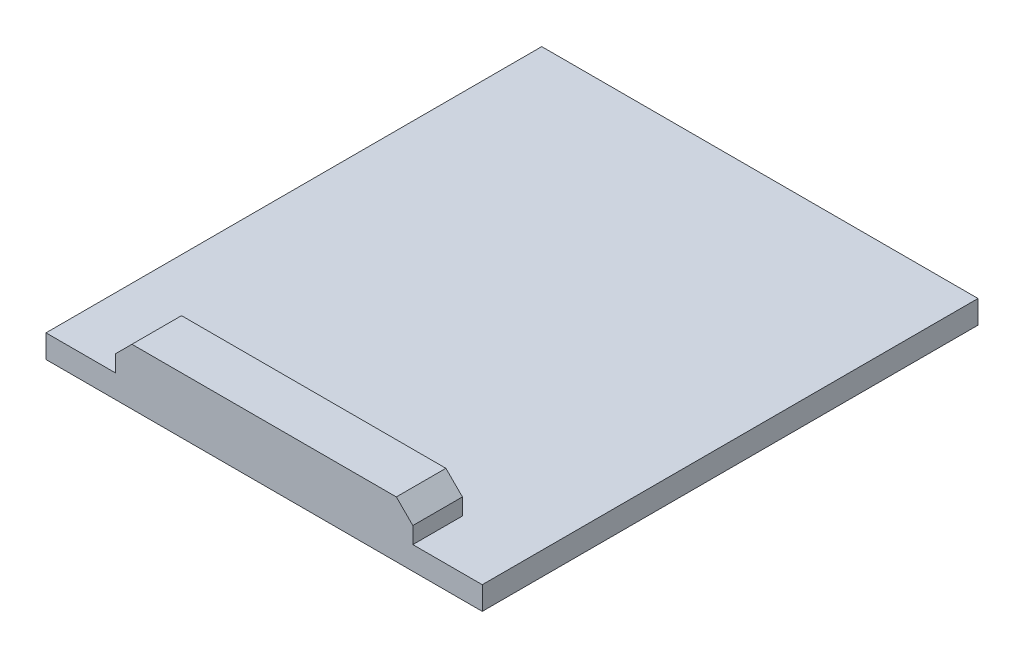
ISO-10303-21;
HEADER;
FILE_DESCRIPTION(('STEP AP214'),'2;1');
FILE_NAME('part.step','',(''),(''),'','','');
FILE_SCHEMA(('AUTOMOTIVE_DESIGN { 1 0 10303 214 1 1 1 1 }'));
ENDSEC;
DATA;
#1=APPLICATION_CONTEXT('core data for automotive mechanical design processes');
#2=APPLICATION_PROTOCOL_DEFINITION('international standard','automotive_design',2000,#1);
#3=PRODUCT_CONTEXT('',#1,'mechanical');
#4=PRODUCT('Part','Part','',(#3));
#5=PRODUCT_RELATED_PRODUCT_CATEGORY('part','',(#4));
#6=PRODUCT_DEFINITION_FORMATION('','',#4);
#7=PRODUCT_DEFINITION_CONTEXT('part definition',#1,'design');
#8=PRODUCT_DEFINITION('design','',#6,#7);
#9=PRODUCT_DEFINITION_SHAPE('','',#8);
#10=(LENGTH_UNIT() NAMED_UNIT(*) SI_UNIT(.MILLI.,.METRE.));
#11=(NAMED_UNIT(*) PLANE_ANGLE_UNIT() SI_UNIT($,.RADIAN.));
#12=(NAMED_UNIT(*) SI_UNIT($,.STERADIAN.) SOLID_ANGLE_UNIT());
#13=UNCERTAINTY_MEASURE_WITH_UNIT(LENGTH_MEASURE(1.E-05),#10,'distance_accuracy_value','');
#14=(GEOMETRIC_REPRESENTATION_CONTEXT(3) GLOBAL_UNCERTAINTY_ASSIGNED_CONTEXT((#13)) GLOBAL_UNIT_ASSIGNED_CONTEXT((#10,
#11,#12)) REPRESENTATION_CONTEXT('',''));
#15=CARTESIAN_POINT('',(0.,0.,0.));
#16=DIRECTION('',(0.,0.,1.));
#17=DIRECTION('',(1.,0.,0.));
#18=AXIS2_PLACEMENT_3D('',#15,#16,#17);
#19=CARTESIAN_POINT('',(26.4,1.4,30.));
#20=DIRECTION('',(0.,-1.,0.));
#21=DIRECTION('',(1.,0.,0.));
#22=AXIS2_PLACEMENT_3D('',#19,#20,#21);
#23=PLANE('',#22);
#24=DIRECTION('',(0.,0.,1.));
#25=VECTOR('',#24,1.);
#26=CARTESIAN_POINT('',(4.2,1.4,27.));
#27=LINE('',#26,#25);
#28=CARTESIAN_POINT('',(4.2,1.4,27.));
#29=VERTEX_POINT('',#28);
#30=CARTESIAN_POINT('',(4.2,1.4,30.));
#31=VERTEX_POINT('',#30);
#32=EDGE_CURVE('E139',#29,#31,#27,.T.);
#33=ORIENTED_EDGE('',*,*,#32,.F.);
#34=DIRECTION('',(1.,0.,0.));
#35=VECTOR('',#34,1.);
#36=CARTESIAN_POINT('',(22.2,1.4,27.));
#37=LINE('',#36,#35);
#38=CARTESIAN_POINT('',(22.2,1.4,27.));
#39=VERTEX_POINT('',#38);
#40=EDGE_CURVE('E132',#29,#39,#37,.T.);
#41=ORIENTED_EDGE('',*,*,#40,.T.);
#42=DIRECTION('',(0.,0.,1.));
#43=VECTOR('',#42,1.);
#44=CARTESIAN_POINT('',(22.2,1.4,27.));
#45=LINE('',#44,#43);
#46=CARTESIAN_POINT('',(22.2,1.4,30.));
#47=VERTEX_POINT('',#46);
#48=EDGE_CURVE('E118',#39,#47,#45,.T.);
#49=ORIENTED_EDGE('',*,*,#48,.T.);
#50=DIRECTION('',(-1.,0.,0.));
#51=VECTOR('',#50,1.);
#52=CARTESIAN_POINT('',(26.4,1.4,30.));
#53=LINE('',#52,#51);
#54=CARTESIAN_POINT('',(26.4,1.4,30.));
#55=VERTEX_POINT('',#54);
#56=EDGE_CURVE('E176',#55,#47,#53,.T.);
#57=ORIENTED_EDGE('',*,*,#56,.F.);
#58=DIRECTION('',(0.,0.,-1.));
#59=VECTOR('',#58,1.);
#60=CARTESIAN_POINT('',(26.4,1.4,30.));
#61=LINE('',#60,#59);
#62=CARTESIAN_POINT('',(26.4,1.4,0.));
#63=VERTEX_POINT('',#62);
#64=EDGE_CURVE('E187',#55,#63,#61,.T.);
#65=ORIENTED_EDGE('',*,*,#64,.T.);
#66=DIRECTION('',(-1.,0.,0.));
#67=VECTOR('',#66,1.);
#68=CARTESIAN_POINT('',(26.4,1.4,0.));
#69=LINE('',#68,#67);
#70=CARTESIAN_POINT('',(0.,1.4,0.));
#71=VERTEX_POINT('',#70);
#72=EDGE_CURVE('E79',#63,#71,#69,.T.);
#73=ORIENTED_EDGE('',*,*,#72,.T.);
#74=DIRECTION('',(0.,0.,-1.));
#75=VECTOR('',#74,1.);
#76=CARTESIAN_POINT('',(0.,1.4,30.));
#77=LINE('',#76,#75);
#78=CARTESIAN_POINT('',(0.,1.4,30.));
#79=VERTEX_POINT('',#78);
#80=EDGE_CURVE('E178',#79,#71,#77,.T.);
#81=ORIENTED_EDGE('',*,*,#80,.F.);
#82=EDGE_CURVE('E57',#31,#79,#53,.T.);
#83=ORIENTED_EDGE('',*,*,#82,.F.);
#84=EDGE_LOOP('',(#33,#41,#49,#57,#65,#73,#81,#83));
#85=FACE_BOUND('',#84,.T.);
#86=ADVANCED_FACE('F33',(#85),#23,.F.);
#87=CARTESIAN_POINT('',(0.,1.4,30.));
#88=DIRECTION('',(1.,0.,0.));
#89=DIRECTION('',(0.,1.,0.));
#90=AXIS2_PLACEMENT_3D('',#87,#88,#89);
#91=PLANE('',#90);
#92=DIRECTION('',(0.,-1.,0.));
#93=VECTOR('',#92,1.);
#94=CARTESIAN_POINT('',(0.,1.4,0.));
#95=LINE('',#94,#93);
#96=CARTESIAN_POINT('',(0.,0.,0.));
#97=VERTEX_POINT('',#96);
#98=EDGE_CURVE('E163',#71,#97,#95,.T.);
#99=ORIENTED_EDGE('',*,*,#98,.T.);
#100=DIRECTION('',(0.,0.,-1.));
#101=VECTOR('',#100,1.);
#102=CARTESIAN_POINT('',(0.,0.,30.));
#103=LINE('',#102,#101);
#104=CARTESIAN_POINT('',(0.,0.,30.));
#105=VERTEX_POINT('',#104);
#106=EDGE_CURVE('E11',#105,#97,#103,.T.);
#107=ORIENTED_EDGE('',*,*,#106,.F.);
#108=DIRECTION('',(0.,-1.,0.));
#109=VECTOR('',#108,1.);
#110=CARTESIAN_POINT('',(0.,1.4,30.));
#111=LINE('',#110,#109);
#112=EDGE_CURVE('E171',#79,#105,#111,.T.);
#113=ORIENTED_EDGE('',*,*,#112,.F.);
#114=ORIENTED_EDGE('',*,*,#80,.T.);
#115=EDGE_LOOP('',(#99,#107,#113,#114));
#116=FACE_BOUND('',#115,.T.);
#117=ADVANCED_FACE('F35',(#116),#91,.F.);
#118=CARTESIAN_POINT('',(0.,0.,30.));
#119=DIRECTION('',(0.,1.,0.));
#120=DIRECTION('',(0.,0.,1.));
#121=AXIS2_PLACEMENT_3D('',#118,#119,#120);
#122=PLANE('',#121);
#123=DIRECTION('',(1.,0.,0.));
#124=VECTOR('',#123,1.);
#125=CARTESIAN_POINT('',(0.,0.,0.));
#126=LINE('',#125,#124);
#127=CARTESIAN_POINT('',(26.4,0.,0.));
#128=VERTEX_POINT('',#127);
#129=EDGE_CURVE('E181',#97,#128,#126,.T.);
#130=ORIENTED_EDGE('',*,*,#129,.T.);
#131=DIRECTION('',(0.,0.,-1.));
#132=VECTOR('',#131,1.);
#133=CARTESIAN_POINT('',(26.4,0.,30.));
#134=LINE('',#133,#132);
#135=CARTESIAN_POINT('',(26.4,0.,30.));
#136=VERTEX_POINT('',#135);
#137=EDGE_CURVE('E41',#136,#128,#134,.T.);
#138=ORIENTED_EDGE('',*,*,#137,.F.);
#139=DIRECTION('',(1.,0.,0.));
#140=VECTOR('',#139,1.);
#141=CARTESIAN_POINT('',(0.,0.,30.));
#142=LINE('',#141,#140);
#143=EDGE_CURVE('E86',#105,#136,#142,.T.);
#144=ORIENTED_EDGE('',*,*,#143,.F.);
#145=ORIENTED_EDGE('',*,*,#106,.T.);
#146=EDGE_LOOP('',(#130,#138,#144,#145));
#147=FACE_BOUND('',#146,.T.);
#148=ADVANCED_FACE('F228',(#147),#122,.F.);
#149=CARTESIAN_POINT('',(26.4,0.,30.));
#150=DIRECTION('',(-1.,0.,0.));
#151=DIRECTION('',(0.,0.,1.));
#152=AXIS2_PLACEMENT_3D('',#149,#150,#151);
#153=PLANE('',#152);
#154=DIRECTION('',(0.,1.,0.));
#155=VECTOR('',#154,1.);
#156=CARTESIAN_POINT('',(26.4,0.,0.));
#157=LINE('',#156,#155);
#158=EDGE_CURVE('E183',#128,#63,#157,.T.);
#159=ORIENTED_EDGE('',*,*,#158,.T.);
#160=ORIENTED_EDGE('',*,*,#64,.F.);
#161=DIRECTION('',(0.,1.,0.));
#162=VECTOR('',#161,1.);
#163=CARTESIAN_POINT('',(26.4,0.,30.));
#164=LINE('',#163,#162);
#165=EDGE_CURVE('E174',#136,#55,#164,.T.);
#166=ORIENTED_EDGE('',*,*,#165,.F.);
#167=ORIENTED_EDGE('',*,*,#137,.T.);
#168=EDGE_LOOP('',(#159,#160,#166,#167));
#169=FACE_BOUND('',#168,.T.);
#170=ADVANCED_FACE('F192',(#169),#153,.F.);
#171=CARTESIAN_POINT('',(0.,0.,30.));
#172=DIRECTION('',(0.,0.,1.));
#173=DIRECTION('',(1.,0.,0.));
#174=AXIS2_PLACEMENT_3D('',#171,#172,#173);
#175=PLANE('',#174);
#176=ORIENTED_EDGE('',*,*,#112,.T.);
#177=ORIENTED_EDGE('',*,*,#143,.T.);
#178=ORIENTED_EDGE('',*,*,#165,.T.);
#179=ORIENTED_EDGE('',*,*,#56,.T.);
#180=DIRECTION('',(0.,1.,0.));
#181=VECTOR('',#180,1.);
#182=CARTESIAN_POINT('',(22.2,2.4,30.));
#183=LINE('',#182,#181);
#184=CARTESIAN_POINT('',(22.2,2.4,30.));
#185=VERTEX_POINT('',#184);
#186=EDGE_CURVE('E48',#47,#185,#183,.T.);
#187=ORIENTED_EDGE('',*,*,#186,.T.);
#188=DIRECTION('',(-0.707106781186547,0.707106781186548,0.));
#189=VECTOR('',#188,1.);
#190=CARTESIAN_POINT('',(21.2,3.4,30.));
#191=LINE('',#190,#189);
#192=CARTESIAN_POINT('',(21.2,3.4,30.));
#193=VERTEX_POINT('',#192);
#194=EDGE_CURVE('E154',#185,#193,#191,.T.);
#195=ORIENTED_EDGE('',*,*,#194,.T.);
#196=DIRECTION('',(-1.,0.,0.));
#197=VECTOR('',#196,1.);
#198=CARTESIAN_POINT('',(5.2,3.4,30.));
#199=LINE('',#198,#197);
#200=CARTESIAN_POINT('',(5.2,3.4,30.));
#201=VERTEX_POINT('',#200);
#202=EDGE_CURVE('E157',#193,#201,#199,.T.);
#203=ORIENTED_EDGE('',*,*,#202,.T.);
#204=DIRECTION('',(-0.707106781186546,-0.707106781186549,0.));
#205=VECTOR('',#204,1.);
#206=CARTESIAN_POINT('',(4.2,2.4,30.));
#207=LINE('',#206,#205);
#208=CARTESIAN_POINT('',(4.2,2.4,30.));
#209=VERTEX_POINT('',#208);
#210=EDGE_CURVE('E142',#201,#209,#207,.T.);
#211=ORIENTED_EDGE('',*,*,#210,.T.);
#212=DIRECTION('',(0.,-1.,0.));
#213=VECTOR('',#212,1.);
#214=CARTESIAN_POINT('',(4.2,1.4,30.));
#215=LINE('',#214,#213);
#216=EDGE_CURVE('E140',#209,#31,#215,.T.);
#217=ORIENTED_EDGE('',*,*,#216,.T.);
#218=ORIENTED_EDGE('',*,*,#82,.T.);
#219=EDGE_LOOP('',(#176,#177,#178,#179,#187,#195,#203,#211,#217,#218));
#220=FACE_BOUND('',#219,.T.);
#221=ADVANCED_FACE('F200',(#220),#175,.T.);
#222=CARTESIAN_POINT('',(0.,0.,0.));
#223=DIRECTION('',(0.,0.,1.));
#224=DIRECTION('',(1.,0.,0.));
#225=AXIS2_PLACEMENT_3D('',#222,#223,#224);
#226=PLANE('',#225);
#227=ORIENTED_EDGE('',*,*,#98,.F.);
#228=ORIENTED_EDGE('',*,*,#72,.F.);
#229=ORIENTED_EDGE('',*,*,#158,.F.);
#230=ORIENTED_EDGE('',*,*,#129,.F.);
#231=EDGE_LOOP('',(#227,#228,#229,#230));
#232=FACE_BOUND('',#231,.T.);
#233=ADVANCED_FACE('F196',(#232),#226,.F.);
#234=CARTESIAN_POINT('',(4.2,1.4,27.));
#235=DIRECTION('',(-1.,0.,0.));
#236=DIRECTION('',(0.,0.,1.));
#237=AXIS2_PLACEMENT_3D('',#234,#235,#236);
#238=PLANE('',#237);
#239=ORIENTED_EDGE('',*,*,#216,.F.);
#240=DIRECTION('',(0.,0.,1.));
#241=VECTOR('',#240,1.);
#242=CARTESIAN_POINT('',(4.2,2.4,27.));
#243=LINE('',#242,#241);
#244=CARTESIAN_POINT('',(4.2,2.4,27.));
#245=VERTEX_POINT('',#244);
#246=EDGE_CURVE('E164',#245,#209,#243,.T.);
#247=ORIENTED_EDGE('',*,*,#246,.F.);
#248=DIRECTION('',(0.,-1.,0.));
#249=VECTOR('',#248,1.);
#250=CARTESIAN_POINT('',(4.2,1.4,27.));
#251=LINE('',#250,#249);
#252=EDGE_CURVE('E126',#245,#29,#251,.T.);
#253=ORIENTED_EDGE('',*,*,#252,.T.);
#254=ORIENTED_EDGE('',*,*,#32,.T.);
#255=EDGE_LOOP('',(#239,#247,#253,#254));
#256=FACE_BOUND('',#255,.T.);
#257=ADVANCED_FACE('F213',(#256),#238,.T.);
#258=CARTESIAN_POINT('',(4.2,2.4,27.));
#259=DIRECTION('',(-0.707106781186549,0.707106781186546,0.));
#260=DIRECTION('',(-0.707106781186546,-0.707106781186549,0.));
#261=AXIS2_PLACEMENT_3D('',#258,#259,#260);
#262=PLANE('',#261);
#263=ORIENTED_EDGE('',*,*,#210,.F.);
#264=DIRECTION('',(0.,0.,1.));
#265=VECTOR('',#264,1.);
#266=CARTESIAN_POINT('',(5.2,3.4,27.));
#267=LINE('',#266,#265);
#268=CARTESIAN_POINT('',(5.2,3.4,27.));
#269=VERTEX_POINT('',#268);
#270=EDGE_CURVE('E166',#269,#201,#267,.T.);
#271=ORIENTED_EDGE('',*,*,#270,.F.);
#272=DIRECTION('',(-0.707106781186546,-0.707106781186549,0.));
#273=VECTOR('',#272,1.);
#274=CARTESIAN_POINT('',(4.2,2.4,27.));
#275=LINE('',#274,#273);
#276=EDGE_CURVE('E149',#269,#245,#275,.T.);
#277=ORIENTED_EDGE('',*,*,#276,.T.);
#278=ORIENTED_EDGE('',*,*,#246,.T.);
#279=EDGE_LOOP('',(#263,#271,#277,#278));
#280=FACE_BOUND('',#279,.T.);
#281=ADVANCED_FACE('F210',(#280),#262,.T.);
#282=CARTESIAN_POINT('',(5.2,3.4,27.));
#283=DIRECTION('',(0.,1.,0.));
#284=DIRECTION('',(0.,0.,1.));
#285=AXIS2_PLACEMENT_3D('',#282,#283,#284);
#286=PLANE('',#285);
#287=ORIENTED_EDGE('',*,*,#202,.F.);
#288=DIRECTION('',(0.,0.,1.));
#289=VECTOR('',#288,1.);
#290=CARTESIAN_POINT('',(21.2,3.4,27.));
#291=LINE('',#290,#289);
#292=CARTESIAN_POINT('',(21.2,3.4,27.));
#293=VERTEX_POINT('',#292);
#294=EDGE_CURVE('E168',#293,#193,#291,.T.);
#295=ORIENTED_EDGE('',*,*,#294,.F.);
#296=DIRECTION('',(-1.,0.,0.));
#297=VECTOR('',#296,1.);
#298=CARTESIAN_POINT('',(5.2,3.4,27.));
#299=LINE('',#298,#297);
#300=EDGE_CURVE('E146',#293,#269,#299,.T.);
#301=ORIENTED_EDGE('',*,*,#300,.T.);
#302=ORIENTED_EDGE('',*,*,#270,.T.);
#303=EDGE_LOOP('',(#287,#295,#301,#302));
#304=FACE_BOUND('',#303,.T.);
#305=ADVANCED_FACE('F206',(#304),#286,.T.);
#306=CARTESIAN_POINT('',(21.2,3.4,27.));
#307=DIRECTION('',(0.707106781186548,0.707106781186547,0.));
#308=DIRECTION('',(-0.707106781186547,0.707106781186548,0.));
#309=AXIS2_PLACEMENT_3D('',#306,#307,#308);
#310=PLANE('',#309);
#311=ORIENTED_EDGE('',*,*,#194,.F.);
#312=DIRECTION('',(0.,0.,1.));
#313=VECTOR('',#312,1.);
#314=CARTESIAN_POINT('',(22.2,2.4,27.));
#315=LINE('',#314,#313);
#316=CARTESIAN_POINT('',(22.2,2.4,27.));
#317=VERTEX_POINT('',#316);
#318=EDGE_CURVE('E125',#317,#185,#315,.T.);
#319=ORIENTED_EDGE('',*,*,#318,.F.);
#320=DIRECTION('',(-0.707106781186547,0.707106781186548,0.));
#321=VECTOR('',#320,1.);
#322=CARTESIAN_POINT('',(21.2,3.4,27.));
#323=LINE('',#322,#321);
#324=EDGE_CURVE('E136',#317,#293,#323,.T.);
#325=ORIENTED_EDGE('',*,*,#324,.T.);
#326=ORIENTED_EDGE('',*,*,#294,.T.);
#327=EDGE_LOOP('',(#311,#319,#325,#326));
#328=FACE_BOUND('',#327,.T.);
#329=ADVANCED_FACE('F204',(#328),#310,.T.);
#330=CARTESIAN_POINT('',(22.2,2.4,27.));
#331=DIRECTION('',(1.,0.,0.));
#332=DIRECTION('',(0.,0.,-1.));
#333=AXIS2_PLACEMENT_3D('',#330,#331,#332);
#334=PLANE('',#333);
#335=ORIENTED_EDGE('',*,*,#186,.F.);
#336=ORIENTED_EDGE('',*,*,#48,.F.);
#337=DIRECTION('',(0.,1.,0.));
#338=VECTOR('',#337,1.);
#339=CARTESIAN_POINT('',(22.2,2.4,27.));
#340=LINE('',#339,#338);
#341=EDGE_CURVE('E121',#39,#317,#340,.T.);
#342=ORIENTED_EDGE('',*,*,#341,.T.);
#343=ORIENTED_EDGE('',*,*,#318,.T.);
#344=EDGE_LOOP('',(#335,#336,#342,#343));
#345=FACE_BOUND('',#344,.T.);
#346=ADVANCED_FACE('F120',(#345),#334,.T.);
#347=CARTESIAN_POINT('',(0.,0.,27.));
#348=DIRECTION('',(0.,0.,-1.));
#349=DIRECTION('',(-1.,0.,0.));
#350=AXIS2_PLACEMENT_3D('',#347,#348,#349);
#351=PLANE('',#350);
#352=ORIENTED_EDGE('',*,*,#40,.F.);
#353=ORIENTED_EDGE('',*,*,#252,.F.);
#354=ORIENTED_EDGE('',*,*,#276,.F.);
#355=ORIENTED_EDGE('',*,*,#300,.F.);
#356=ORIENTED_EDGE('',*,*,#324,.F.);
#357=ORIENTED_EDGE('',*,*,#341,.F.);
#358=EDGE_LOOP('',(#352,#353,#354,#355,#356,#357));
#359=FACE_BOUND('',#358,.T.);
#360=ADVANCED_FACE('F130',(#359),#351,.T.);
#361=CLOSED_SHELL('',(#86,#117,#148,#170,#221,#233,#257,#281,#305,#329,#346,#360));
#362=MANIFOLD_SOLID_BREP('B2',#361);
#363=ADVANCED_BREP_SHAPE_REPRESENTATION('',(#18,#362),#14);
#364=SHAPE_DEFINITION_REPRESENTATION(#9,#363);
ENDSEC;
END-ISO-10303-21;
